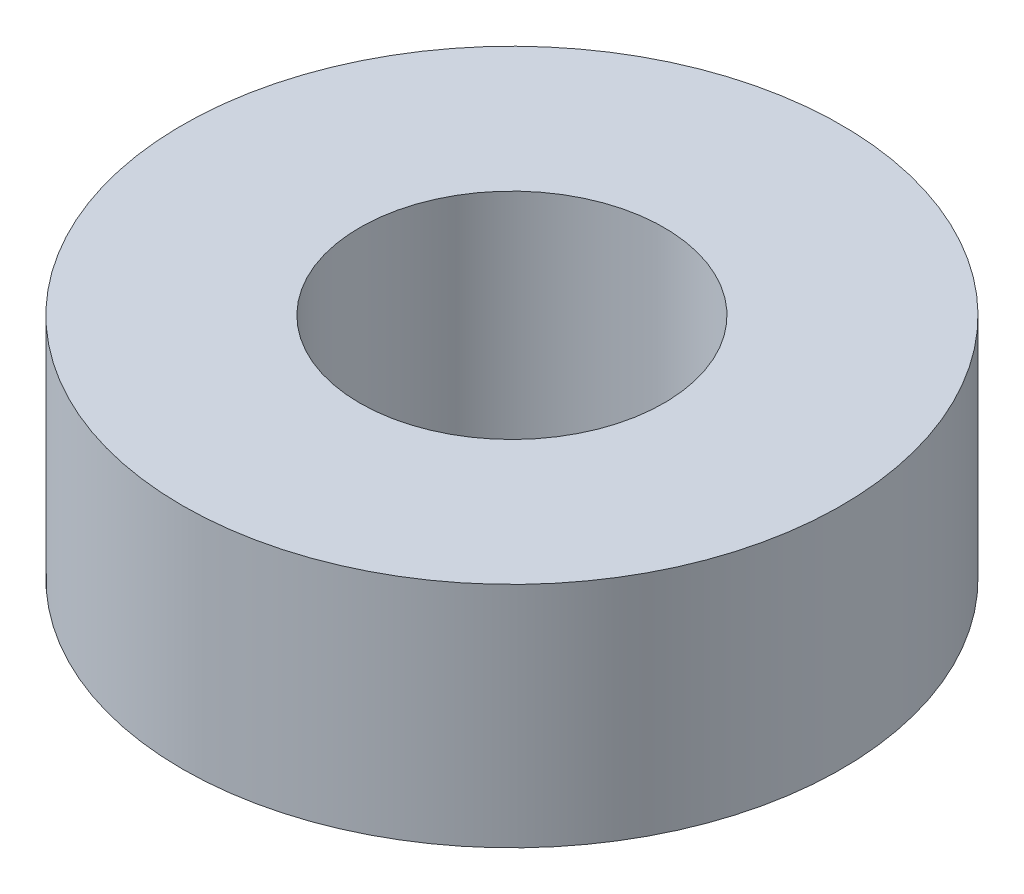
ISO-10303-21;
HEADER;
FILE_DESCRIPTION(('STEP AP214'),'2;1');
FILE_NAME('part.step','',(''),(''),'','','');
FILE_SCHEMA(('AUTOMOTIVE_DESIGN { 1 0 10303 214 1 1 1 1 }'));
ENDSEC;
DATA;
#1=APPLICATION_CONTEXT('core data for automotive mechanical design processes');
#2=APPLICATION_PROTOCOL_DEFINITION('international standard','automotive_design',2000,#1);
#3=PRODUCT_CONTEXT('',#1,'mechanical');
#4=PRODUCT('Part','Part','',(#3));
#5=PRODUCT_RELATED_PRODUCT_CATEGORY('part','',(#4));
#6=PRODUCT_DEFINITION_FORMATION('','',#4);
#7=PRODUCT_DEFINITION_CONTEXT('part definition',#1,'design');
#8=PRODUCT_DEFINITION('design','',#6,#7);
#9=PRODUCT_DEFINITION_SHAPE('','',#8);
#10=(LENGTH_UNIT() NAMED_UNIT(*) SI_UNIT(.MILLI.,.METRE.));
#11=(NAMED_UNIT(*) PLANE_ANGLE_UNIT() SI_UNIT($,.RADIAN.));
#12=(NAMED_UNIT(*) SI_UNIT($,.STERADIAN.) SOLID_ANGLE_UNIT());
#13=UNCERTAINTY_MEASURE_WITH_UNIT(LENGTH_MEASURE(1.E-05),#10,'distance_accuracy_value','');
#14=(GEOMETRIC_REPRESENTATION_CONTEXT(3) GLOBAL_UNCERTAINTY_ASSIGNED_CONTEXT((#13)) GLOBAL_UNIT_ASSIGNED_CONTEXT((#10,
#11,#12)) REPRESENTATION_CONTEXT('',''));
#15=CARTESIAN_POINT('',(0.,0.,0.));
#16=DIRECTION('',(0.,0.,1.));
#17=DIRECTION('',(1.,0.,0.));
#18=AXIS2_PLACEMENT_3D('',#15,#16,#17);
#19=CARTESIAN_POINT('',(0.,4.5,0.));
#20=DIRECTION('',(0.,1.,0.));
#21=DIRECTION('',(0.,0.,1.));
#22=AXIS2_PLACEMENT_3D('',#19,#20,#21);
#23=PLANE('',#22);
#24=CARTESIAN_POINT('',(0.,4.5,0.));
#25=DIRECTION('',(0.,1.,0.));
#26=DIRECTION('',(0.,0.,1.));
#27=AXIS2_PLACEMENT_3D('',#24,#25,#26);
#28=CIRCLE('',#27,6.5);
#29=CARTESIAN_POINT('',(0.,4.5,6.5));
#30=VERTEX_POINT('',#29);
#31=EDGE_CURVE('E10',#30,#30,#28,.T.);
#32=ORIENTED_EDGE('',*,*,#31,.T.);
#33=EDGE_LOOP('',(#32));
#34=FACE_BOUND('',#33,.T.);
#35=CARTESIAN_POINT('',(0.,4.5,0.));
#36=DIRECTION('',(0.,1.,0.));
#37=DIRECTION('',(0.,0.,1.));
#38=AXIS2_PLACEMENT_3D('',#35,#36,#37);
#39=CIRCLE('',#38,3.);
#40=CARTESIAN_POINT('',(0.,4.5,3.));
#41=VERTEX_POINT('',#40);
#42=EDGE_CURVE('E50',#41,#41,#39,.T.);
#43=ORIENTED_EDGE('',*,*,#42,.F.);
#44=EDGE_LOOP('',(#43));
#45=FACE_BOUND('',#44,.T.);
#46=ADVANCED_FACE('F37',(#34,#45),#23,.T.);
#47=CARTESIAN_POINT('',(0.,0.,0.));
#48=DIRECTION('',(0.,1.,0.));
#49=DIRECTION('',(0.,0.,1.));
#50=AXIS2_PLACEMENT_3D('',#47,#48,#49);
#51=PLANE('',#50);
#52=CARTESIAN_POINT('',(0.,0.,0.));
#53=DIRECTION('',(0.,1.,0.));
#54=DIRECTION('',(0.,0.,1.));
#55=AXIS2_PLACEMENT_3D('',#52,#53,#54);
#56=CIRCLE('',#55,6.5);
#57=CARTESIAN_POINT('',(0.,0.,6.5));
#58=VERTEX_POINT('',#57);
#59=EDGE_CURVE('E41',#58,#58,#56,.T.);
#60=ORIENTED_EDGE('',*,*,#59,.F.);
#61=EDGE_LOOP('',(#60));
#62=FACE_BOUND('',#61,.T.);
#63=CARTESIAN_POINT('',(0.,0.,0.));
#64=DIRECTION('',(0.,1.,0.));
#65=DIRECTION('',(0.,0.,1.));
#66=AXIS2_PLACEMENT_3D('',#63,#64,#65);
#67=CIRCLE('',#66,3.);
#68=CARTESIAN_POINT('',(0.,0.,3.));
#69=VERTEX_POINT('',#68);
#70=EDGE_CURVE('E52',#69,#69,#67,.T.);
#71=ORIENTED_EDGE('',*,*,#70,.T.);
#72=EDGE_LOOP('',(#71));
#73=FACE_BOUND('',#72,.T.);
#74=ADVANCED_FACE('F64',(#62,#73),#51,.F.);
#75=CARTESIAN_POINT('',(0.,4.5,0.));
#76=DIRECTION('',(0.,-1.,0.));
#77=DIRECTION('',(0.,0.,-1.));
#78=AXIS2_PLACEMENT_3D('',#75,#76,#77);
#79=CYLINDRICAL_SURFACE('',#78,6.5);
#80=ORIENTED_EDGE('',*,*,#31,.F.);
#81=EDGE_LOOP('',(#80));
#82=FACE_BOUND('',#81,.T.);
#83=ORIENTED_EDGE('',*,*,#59,.T.);
#84=EDGE_LOOP('',(#83));
#85=FACE_BOUND('',#84,.T.);
#86=ADVANCED_FACE('F39',(#82,#85),#79,.T.);
#87=CARTESIAN_POINT('',(0.,4.5,0.));
#88=DIRECTION('',(0.,-1.,0.));
#89=DIRECTION('',(0.,0.,-1.));
#90=AXIS2_PLACEMENT_3D('',#87,#88,#89);
#91=CYLINDRICAL_SURFACE('',#90,3.);
#92=ORIENTED_EDGE('',*,*,#42,.T.);
#93=EDGE_LOOP('',(#92));
#94=FACE_BOUND('',#93,.T.);
#95=ORIENTED_EDGE('',*,*,#70,.F.);
#96=EDGE_LOOP('',(#95));
#97=FACE_BOUND('',#96,.T.);
#98=ADVANCED_FACE('F60',(#94,#97),#91,.F.);
#99=CLOSED_SHELL('',(#46,#74,#86,#98));
#100=MANIFOLD_SOLID_BREP('B2',#99);
#101=ADVANCED_BREP_SHAPE_REPRESENTATION('',(#18,#100),#14);
#102=SHAPE_DEFINITION_REPRESENTATION(#9,#101);
ENDSEC;
END-ISO-10303-21;
